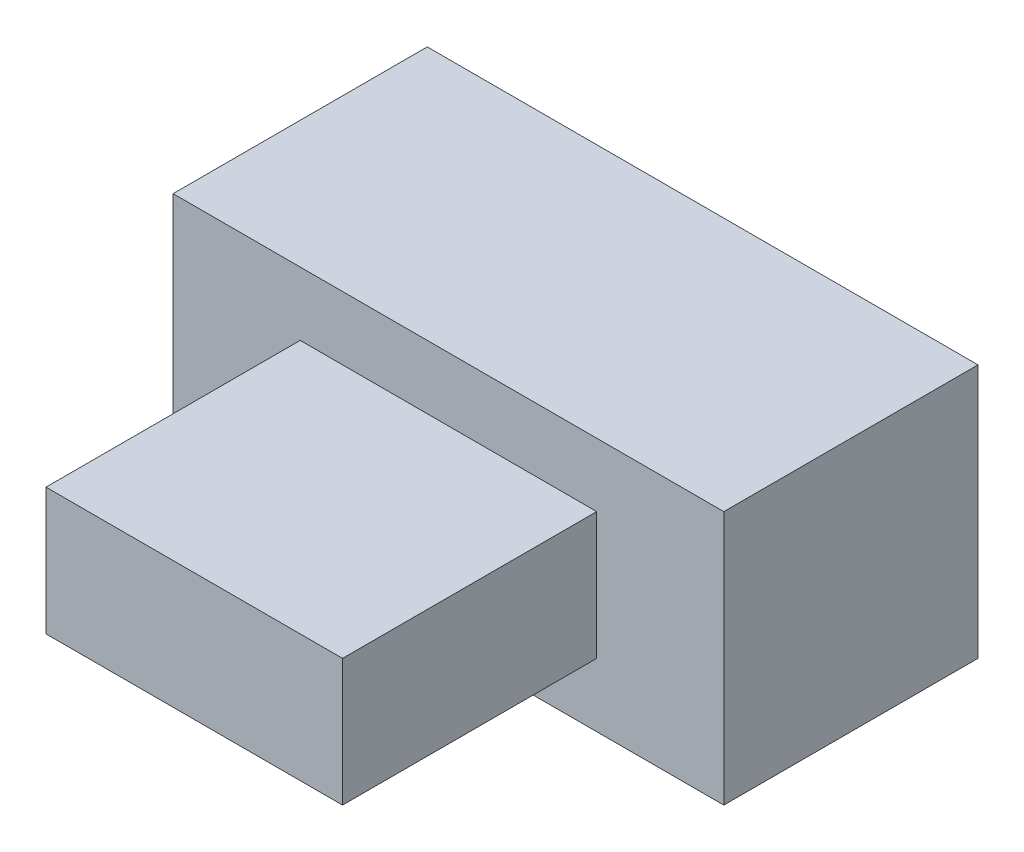
ISO-10303-21;
HEADER;
FILE_DESCRIPTION(('STEP AP214'),'2;1');
FILE_NAME('part.step','',(''),(''),'','','');
FILE_SCHEMA(('AUTOMOTIVE_DESIGN { 1 0 10303 214 1 1 1 1 }'));
ENDSEC;
DATA;
#1=APPLICATION_CONTEXT('core data for automotive mechanical design processes');
#2=APPLICATION_PROTOCOL_DEFINITION('international standard','automotive_design',2000,#1);
#3=PRODUCT_CONTEXT('',#1,'mechanical');
#4=PRODUCT('Part','Part','',(#3));
#5=PRODUCT_RELATED_PRODUCT_CATEGORY('part','',(#4));
#6=PRODUCT_DEFINITION_FORMATION('','',#4);
#7=PRODUCT_DEFINITION_CONTEXT('part definition',#1,'design');
#8=PRODUCT_DEFINITION('design','',#6,#7);
#9=PRODUCT_DEFINITION_SHAPE('','',#8);
#10=(LENGTH_UNIT() NAMED_UNIT(*) SI_UNIT(.MILLI.,.METRE.));
#11=(NAMED_UNIT(*) PLANE_ANGLE_UNIT() SI_UNIT($,.RADIAN.));
#12=(NAMED_UNIT(*) SI_UNIT($,.STERADIAN.) SOLID_ANGLE_UNIT());
#13=UNCERTAINTY_MEASURE_WITH_UNIT(LENGTH_MEASURE(1.E-05),#10,'distance_accuracy_value','');
#14=(GEOMETRIC_REPRESENTATION_CONTEXT(3) GLOBAL_UNCERTAINTY_ASSIGNED_CONTEXT((#13)) GLOBAL_UNIT_ASSIGNED_CONTEXT((#10,
#11,#12)) REPRESENTATION_CONTEXT('',''));
#15=CARTESIAN_POINT('',(0.,0.,0.));
#16=DIRECTION('',(0.,0.,1.));
#17=DIRECTION('',(1.,0.,0.));
#18=AXIS2_PLACEMENT_3D('',#15,#16,#17);
#19=CARTESIAN_POINT('',(0.,0.,6.));
#20=DIRECTION('',(0.,0.,-1.));
#21=DIRECTION('',(-1.,0.,0.));
#22=AXIS2_PLACEMENT_3D('',#19,#20,#21);
#23=PLANE('',#22);
#24=DIRECTION('',(0.,-1.,0.));
#25=VECTOR('',#24,1.);
#26=CARTESIAN_POINT('',(0.,0.,6.));
#27=LINE('',#26,#25);
#28=CARTESIAN_POINT('',(0.,6.,6.));
#29=VERTEX_POINT('',#28);
#30=CARTESIAN_POINT('',(0.,0.,6.));
#31=VERTEX_POINT('',#30);
#32=EDGE_CURVE('E128',#29,#31,#27,.T.);
#33=ORIENTED_EDGE('',*,*,#32,.T.);
#34=DIRECTION('',(1.,0.,0.));
#35=VECTOR('',#34,1.);
#36=CARTESIAN_POINT('',(0.,0.,6.));
#37=LINE('',#36,#35);
#38=CARTESIAN_POINT('',(13.,0.,6.));
#39=VERTEX_POINT('',#38);
#40=EDGE_CURVE('E131',#31,#39,#37,.T.);
#41=ORIENTED_EDGE('',*,*,#40,.T.);
#42=DIRECTION('',(0.,1.,0.));
#43=VECTOR('',#42,1.);
#44=CARTESIAN_POINT('',(13.,0.,6.));
#45=LINE('',#44,#43);
#46=CARTESIAN_POINT('',(13.,6.,6.));
#47=VERTEX_POINT('',#46);
#48=EDGE_CURVE('E134',#39,#47,#45,.T.);
#49=ORIENTED_EDGE('',*,*,#48,.T.);
#50=DIRECTION('',(-1.,0.,0.));
#51=VECTOR('',#50,1.);
#52=CARTESIAN_POINT('',(0.,6.,6.));
#53=LINE('',#52,#51);
#54=EDGE_CURVE('E136',#47,#29,#53,.T.);
#55=ORIENTED_EDGE('',*,*,#54,.T.);
#56=EDGE_LOOP('',(#33,#41,#49,#55));
#57=FACE_BOUND('',#56,.T.);
#58=DIRECTION('',(0.,-1.,0.));
#59=VECTOR('',#58,1.);
#60=CARTESIAN_POINT('',(3.,4.5,6.));
#61=LINE('',#60,#59);
#62=CARTESIAN_POINT('',(3.,4.5,6.));
#63=VERTEX_POINT('',#62);
#64=CARTESIAN_POINT('',(3.,1.5,6.));
#65=VERTEX_POINT('',#64);
#66=EDGE_CURVE('E118',#63,#65,#61,.T.);
#67=ORIENTED_EDGE('',*,*,#66,.F.);
#68=DIRECTION('',(-1.,0.,0.));
#69=VECTOR('',#68,1.);
#70=CARTESIAN_POINT('',(3.,4.5,6.));
#71=LINE('',#70,#69);
#72=CARTESIAN_POINT('',(10.,4.5,6.));
#73=VERTEX_POINT('',#72);
#74=EDGE_CURVE('E115',#73,#63,#71,.T.);
#75=ORIENTED_EDGE('',*,*,#74,.F.);
#76=DIRECTION('',(0.,1.,0.));
#77=VECTOR('',#76,1.);
#78=CARTESIAN_POINT('',(10.,4.5,6.));
#79=LINE('',#78,#77);
#80=CARTESIAN_POINT('',(10.,1.5,6.));
#81=VERTEX_POINT('',#80);
#82=EDGE_CURVE('E53',#81,#73,#79,.T.);
#83=ORIENTED_EDGE('',*,*,#82,.F.);
#84=DIRECTION('',(1.,0.,0.));
#85=VECTOR('',#84,1.);
#86=CARTESIAN_POINT('',(3.,1.5,6.));
#87=LINE('',#86,#85);
#88=EDGE_CURVE('E48',#65,#81,#87,.T.);
#89=ORIENTED_EDGE('',*,*,#88,.F.);
#90=EDGE_LOOP('',(#67,#75,#83,#89));
#91=FACE_BOUND('',#90,.T.);
#92=ADVANCED_FACE('F33',(#57,#91),#23,.F.);
#93=CARTESIAN_POINT('',(0.,0.,6.));
#94=DIRECTION('',(1.,0.,0.));
#95=DIRECTION('',(0.,0.,-1.));
#96=AXIS2_PLACEMENT_3D('',#93,#94,#95);
#97=PLANE('',#96);
#98=DIRECTION('',(0.,-1.,0.));
#99=VECTOR('',#98,1.);
#100=CARTESIAN_POINT('',(0.,0.,0.));
#101=LINE('',#100,#99);
#102=CARTESIAN_POINT('',(0.,6.,0.));
#103=VERTEX_POINT('',#102);
#104=CARTESIAN_POINT('',(0.,0.,0.));
#105=VERTEX_POINT('',#104);
#106=EDGE_CURVE('E119',#103,#105,#101,.T.);
#107=ORIENTED_EDGE('',*,*,#106,.T.);
#108=DIRECTION('',(0.,0.,-1.));
#109=VECTOR('',#108,1.);
#110=CARTESIAN_POINT('',(0.,0.,6.));
#111=LINE('',#110,#109);
#112=EDGE_CURVE('E11',#31,#105,#111,.T.);
#113=ORIENTED_EDGE('',*,*,#112,.F.);
#114=ORIENTED_EDGE('',*,*,#32,.F.);
#115=DIRECTION('',(0.,0.,-1.));
#116=VECTOR('',#115,1.);
#117=CARTESIAN_POINT('',(0.,6.,6.));
#118=LINE('',#117,#116);
#119=EDGE_CURVE('E137',#29,#103,#118,.T.);
#120=ORIENTED_EDGE('',*,*,#119,.T.);
#121=EDGE_LOOP('',(#107,#113,#114,#120));
#122=FACE_BOUND('',#121,.T.);
#123=ADVANCED_FACE('F35',(#122),#97,.F.);
#124=CARTESIAN_POINT('',(0.,0.,6.));
#125=DIRECTION('',(0.,1.,0.));
#126=DIRECTION('',(0.,0.,1.));
#127=AXIS2_PLACEMENT_3D('',#124,#125,#126);
#128=PLANE('',#127);
#129=DIRECTION('',(1.,0.,0.));
#130=VECTOR('',#129,1.);
#131=CARTESIAN_POINT('',(0.,0.,0.));
#132=LINE('',#131,#130);
#133=CARTESIAN_POINT('',(13.,0.,0.));
#134=VERTEX_POINT('',#133);
#135=EDGE_CURVE('E122',#105,#134,#132,.T.);
#136=ORIENTED_EDGE('',*,*,#135,.T.);
#137=DIRECTION('',(0.,0.,-1.));
#138=VECTOR('',#137,1.);
#139=CARTESIAN_POINT('',(13.,0.,6.));
#140=LINE('',#139,#138);
#141=EDGE_CURVE('E41',#39,#134,#140,.T.);
#142=ORIENTED_EDGE('',*,*,#141,.F.);
#143=ORIENTED_EDGE('',*,*,#40,.F.);
#144=ORIENTED_EDGE('',*,*,#112,.T.);
#145=EDGE_LOOP('',(#136,#142,#143,#144));
#146=FACE_BOUND('',#145,.T.);
#147=ADVANCED_FACE('F167',(#146),#128,.F.);
#148=CARTESIAN_POINT('',(13.,0.,6.));
#149=DIRECTION('',(-1.,0.,0.));
#150=DIRECTION('',(0.,0.,1.));
#151=AXIS2_PLACEMENT_3D('',#148,#149,#150);
#152=PLANE('',#151);
#153=DIRECTION('',(0.,1.,0.));
#154=VECTOR('',#153,1.);
#155=CARTESIAN_POINT('',(13.,0.,0.));
#156=LINE('',#155,#154);
#157=CARTESIAN_POINT('',(13.,6.,0.));
#158=VERTEX_POINT('',#157);
#159=EDGE_CURVE('E140',#134,#158,#156,.T.);
#160=ORIENTED_EDGE('',*,*,#159,.T.);
#161=DIRECTION('',(0.,0.,-1.));
#162=VECTOR('',#161,1.);
#163=CARTESIAN_POINT('',(13.,6.,6.));
#164=LINE('',#163,#162);
#165=EDGE_CURVE('E145',#47,#158,#164,.T.);
#166=ORIENTED_EDGE('',*,*,#165,.F.);
#167=ORIENTED_EDGE('',*,*,#48,.F.);
#168=ORIENTED_EDGE('',*,*,#141,.T.);
#169=EDGE_LOOP('',(#160,#166,#167,#168));
#170=FACE_BOUND('',#169,.T.);
#171=ADVANCED_FACE('F152',(#170),#152,.F.);
#172=CARTESIAN_POINT('',(0.,6.,6.));
#173=DIRECTION('',(0.,-1.,0.));
#174=DIRECTION('',(0.,0.,-1.));
#175=AXIS2_PLACEMENT_3D('',#172,#173,#174);
#176=PLANE('',#175);
#177=DIRECTION('',(-1.,0.,0.));
#178=VECTOR('',#177,1.);
#179=CARTESIAN_POINT('',(0.,6.,0.));
#180=LINE('',#179,#178);
#181=EDGE_CURVE('E132',#158,#103,#180,.T.);
#182=ORIENTED_EDGE('',*,*,#181,.T.);
#183=ORIENTED_EDGE('',*,*,#119,.F.);
#184=ORIENTED_EDGE('',*,*,#54,.F.);
#185=ORIENTED_EDGE('',*,*,#165,.T.);
#186=EDGE_LOOP('',(#182,#183,#184,#185));
#187=FACE_BOUND('',#186,.T.);
#188=ADVANCED_FACE('F161',(#187),#176,.F.);
#189=CARTESIAN_POINT('',(0.,0.,0.));
#190=DIRECTION('',(0.,0.,-1.));
#191=DIRECTION('',(-1.,0.,0.));
#192=AXIS2_PLACEMENT_3D('',#189,#190,#191);
#193=PLANE('',#192);
#194=ORIENTED_EDGE('',*,*,#106,.F.);
#195=ORIENTED_EDGE('',*,*,#181,.F.);
#196=ORIENTED_EDGE('',*,*,#159,.F.);
#197=ORIENTED_EDGE('',*,*,#135,.F.);
#198=EDGE_LOOP('',(#194,#195,#196,#197));
#199=FACE_BOUND('',#198,.T.);
#200=ADVANCED_FACE('F158',(#199),#193,.T.);
#201=CARTESIAN_POINT('',(3.,4.5,12.));
#202=DIRECTION('',(1.,0.,0.));
#203=DIRECTION('',(0.,0.,-1.));
#204=AXIS2_PLACEMENT_3D('',#201,#202,#203);
#205=PLANE('',#204);
#206=ORIENTED_EDGE('',*,*,#66,.T.);
#207=DIRECTION('',(0.,0.,-1.));
#208=VECTOR('',#207,1.);
#209=CARTESIAN_POINT('',(3.,1.5,12.));
#210=LINE('',#209,#208);
#211=CARTESIAN_POINT('',(3.,1.5,12.));
#212=VERTEX_POINT('',#211);
#213=EDGE_CURVE('E99',#212,#65,#210,.T.);
#214=ORIENTED_EDGE('',*,*,#213,.F.);
#215=DIRECTION('',(0.,-1.,0.));
#216=VECTOR('',#215,1.);
#217=CARTESIAN_POINT('',(3.,4.5,12.));
#218=LINE('',#217,#216);
#219=CARTESIAN_POINT('',(3.,4.5,12.));
#220=VERTEX_POINT('',#219);
#221=EDGE_CURVE('E106',#220,#212,#218,.T.);
#222=ORIENTED_EDGE('',*,*,#221,.F.);
#223=DIRECTION('',(0.,0.,-1.));
#224=VECTOR('',#223,1.);
#225=CARTESIAN_POINT('',(3.,4.5,12.));
#226=LINE('',#225,#224);
#227=EDGE_CURVE('E260',#220,#63,#226,.T.);
#228=ORIENTED_EDGE('',*,*,#227,.T.);
#229=EDGE_LOOP('',(#206,#214,#222,#228));
#230=FACE_BOUND('',#229,.T.);
#231=ADVANCED_FACE('F117',(#230),#205,.F.);
#232=CARTESIAN_POINT('',(3.,1.5,12.));
#233=DIRECTION('',(0.,1.,0.));
#234=DIRECTION('',(-1.,0.,0.));
#235=AXIS2_PLACEMENT_3D('',#232,#233,#234);
#236=PLANE('',#235);
#237=ORIENTED_EDGE('',*,*,#88,.T.);
#238=DIRECTION('',(0.,0.,-1.));
#239=VECTOR('',#238,1.);
#240=CARTESIAN_POINT('',(10.,1.5,12.));
#241=LINE('',#240,#239);
#242=CARTESIAN_POINT('',(10.,1.5,12.));
#243=VERTEX_POINT('',#242);
#244=EDGE_CURVE('E102',#243,#81,#241,.T.);
#245=ORIENTED_EDGE('',*,*,#244,.F.);
#246=DIRECTION('',(1.,0.,0.));
#247=VECTOR('',#246,1.);
#248=CARTESIAN_POINT('',(3.,1.5,12.));
#249=LINE('',#248,#247);
#250=EDGE_CURVE('E95',#212,#243,#249,.T.);
#251=ORIENTED_EDGE('',*,*,#250,.F.);
#252=ORIENTED_EDGE('',*,*,#213,.T.);
#253=EDGE_LOOP('',(#237,#245,#251,#252));
#254=FACE_BOUND('',#253,.T.);
#255=ADVANCED_FACE('F97',(#254),#236,.F.);
#256=CARTESIAN_POINT('',(10.,4.5,12.));
#257=DIRECTION('',(-1.,0.,0.));
#258=DIRECTION('',(0.,0.,1.));
#259=AXIS2_PLACEMENT_3D('',#256,#257,#258);
#260=PLANE('',#259);
#261=ORIENTED_EDGE('',*,*,#82,.T.);
#262=DIRECTION('',(0.,0.,-1.));
#263=VECTOR('',#262,1.);
#264=CARTESIAN_POINT('',(10.,4.5,12.));
#265=LINE('',#264,#263);
#266=CARTESIAN_POINT('',(10.,4.5,12.));
#267=VERTEX_POINT('',#266);
#268=EDGE_CURVE('E124',#267,#73,#265,.T.);
#269=ORIENTED_EDGE('',*,*,#268,.F.);
#270=DIRECTION('',(0.,1.,0.));
#271=VECTOR('',#270,1.);
#272=CARTESIAN_POINT('',(10.,4.5,12.));
#273=LINE('',#272,#271);
#274=EDGE_CURVE('E105',#243,#267,#273,.T.);
#275=ORIENTED_EDGE('',*,*,#274,.F.);
#276=ORIENTED_EDGE('',*,*,#244,.T.);
#277=EDGE_LOOP('',(#261,#269,#275,#276));
#278=FACE_BOUND('',#277,.T.);
#279=ADVANCED_FACE('F203',(#278),#260,.F.);
#280=CARTESIAN_POINT('',(3.,4.5,12.));
#281=DIRECTION('',(0.,-1.,0.));
#282=DIRECTION('',(1.,0.,0.));
#283=AXIS2_PLACEMENT_3D('',#280,#281,#282);
#284=PLANE('',#283);
#285=ORIENTED_EDGE('',*,*,#74,.T.);
#286=ORIENTED_EDGE('',*,*,#227,.F.);
#287=DIRECTION('',(-1.,0.,0.));
#288=VECTOR('',#287,1.);
#289=CARTESIAN_POINT('',(3.,4.5,12.));
#290=LINE('',#289,#288);
#291=EDGE_CURVE('E111',#267,#220,#290,.T.);
#292=ORIENTED_EDGE('',*,*,#291,.F.);
#293=ORIENTED_EDGE('',*,*,#268,.T.);
#294=EDGE_LOOP('',(#285,#286,#292,#293));
#295=FACE_BOUND('',#294,.T.);
#296=ADVANCED_FACE('F209',(#295),#284,.F.);
#297=CARTESIAN_POINT('',(0.,0.,12.));
#298=DIRECTION('',(0.,0.,1.));
#299=DIRECTION('',(1.,0.,0.));
#300=AXIS2_PLACEMENT_3D('',#297,#298,#299);
#301=PLANE('',#300);
#302=ORIENTED_EDGE('',*,*,#221,.T.);
#303=ORIENTED_EDGE('',*,*,#250,.T.);
#304=ORIENTED_EDGE('',*,*,#274,.T.);
#305=ORIENTED_EDGE('',*,*,#291,.T.);
#306=EDGE_LOOP('',(#302,#303,#304,#305));
#307=FACE_BOUND('',#306,.T.);
#308=ADVANCED_FACE('F109',(#307),#301,.T.);
#309=CLOSED_SHELL('',(#92,#123,#147,#171,#188,#200,#231,#255,#279,#296,#308));
#310=MANIFOLD_SOLID_BREP('B2',#309);
#311=ADVANCED_BREP_SHAPE_REPRESENTATION('',(#18,#310),#14);
#312=SHAPE_DEFINITION_REPRESENTATION(#9,#311);
ENDSEC;
END-ISO-10303-21;
